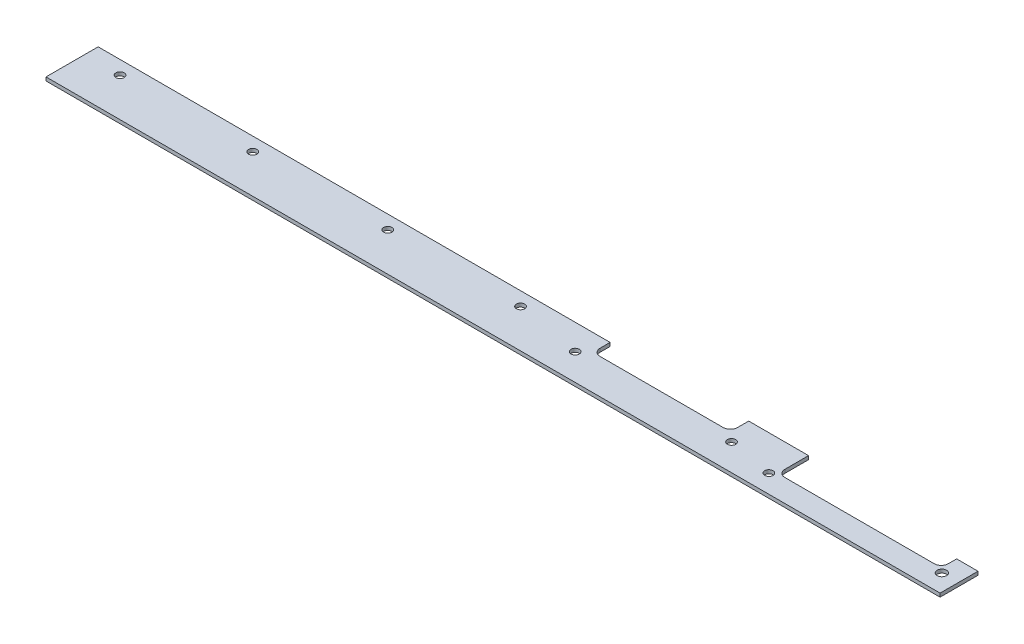
ISO-10303-21;
HEADER;
FILE_DESCRIPTION(('STEP AP214'),'2;1');
FILE_NAME('part.step','',(''),(''),'','','');
FILE_SCHEMA(('AUTOMOTIVE_DESIGN { 1 0 10303 214 1 1 1 1 }'));
ENDSEC;
DATA;
#1=APPLICATION_CONTEXT('core data for automotive mechanical design processes');
#2=APPLICATION_PROTOCOL_DEFINITION('international standard','automotive_design',2000,#1);
#3=PRODUCT_CONTEXT('',#1,'mechanical');
#4=PRODUCT('Part','Part','',(#3));
#5=PRODUCT_RELATED_PRODUCT_CATEGORY('part','',(#4));
#6=PRODUCT_DEFINITION_FORMATION('','',#4);
#7=PRODUCT_DEFINITION_CONTEXT('part definition',#1,'design');
#8=PRODUCT_DEFINITION('design','',#6,#7);
#9=PRODUCT_DEFINITION_SHAPE('','',#8);
#10=(LENGTH_UNIT() NAMED_UNIT(*) SI_UNIT(.MILLI.,.METRE.));
#11=(NAMED_UNIT(*) PLANE_ANGLE_UNIT() SI_UNIT($,.RADIAN.));
#12=(NAMED_UNIT(*) SI_UNIT($,.STERADIAN.) SOLID_ANGLE_UNIT());
#13=UNCERTAINTY_MEASURE_WITH_UNIT(LENGTH_MEASURE(1.E-05),#10,'distance_accuracy_value','');
#14=(GEOMETRIC_REPRESENTATION_CONTEXT(3) GLOBAL_UNCERTAINTY_ASSIGNED_CONTEXT((#13)) GLOBAL_UNIT_ASSIGNED_CONTEXT((#10,
#11,#12)) REPRESENTATION_CONTEXT('',''));
#15=CARTESIAN_POINT('',(0.,0.,0.));
#16=DIRECTION('',(0.,0.,1.));
#17=DIRECTION('',(1.,0.,0.));
#18=AXIS2_PLACEMENT_3D('',#15,#16,#17);
#19=CARTESIAN_POINT('',(219.05,1.5,-17.75));
#20=DIRECTION('',(0.,1.,0.));
#21=DIRECTION('',(0.,0.,1.));
#22=AXIS2_PLACEMENT_3D('',#19,#20,#21);
#23=PLANE('',#22);
#24=CARTESIAN_POINT('',(212.05,1.5,-11.25));
#25=DIRECTION('',(0.,1.,0.));
#26=DIRECTION('',(0.,0.,1.));
#27=AXIS2_PLACEMENT_3D('',#24,#25,#26);
#28=CIRCLE('',#27,1.74999999999998);
#29=CARTESIAN_POINT('',(212.05,1.5,-9.50000000000002));
#30=VERTEX_POINT('',#29);
#31=EDGE_CURVE('E412',#30,#30,#28,.T.);
#32=ORIENTED_EDGE('',*,*,#31,.F.);
#33=EDGE_LOOP('',(#32));
#34=FACE_BOUND('',#33,.T.);
#35=CARTESIAN_POINT('',(184.,1.5,-16.25));
#36=DIRECTION('',(0.,1.,0.));
#37=DIRECTION('',(0.,0.,1.));
#38=AXIS2_PLACEMENT_3D('',#35,#36,#37);
#39=CIRCLE('',#38,1.74999999999998);
#40=CARTESIAN_POINT('',(184.,1.5,-14.5));
#41=VERTEX_POINT('',#40);
#42=EDGE_CURVE('E428',#41,#41,#39,.T.);
#43=ORIENTED_EDGE('',*,*,#42,.F.);
#44=EDGE_LOOP('',(#43));
#45=FACE_BOUND('',#44,.T.);
#46=CARTESIAN_POINT('',(297.3,1.5,-7.75));
#47=DIRECTION('',(0.,1.,0.));
#48=DIRECTION('',(0.,0.,1.));
#49=AXIS2_PLACEMENT_3D('',#46,#47,#48);
#50=CIRCLE('',#49,1.75000000000004);
#51=CARTESIAN_POINT('',(297.3,1.5,-5.99999999999996));
#52=VERTEX_POINT('',#51);
#53=EDGE_CURVE('E444',#52,#52,#50,.T.);
#54=ORIENTED_EDGE('',*,*,#53,.F.);
#55=EDGE_LOOP('',(#54));
#56=FACE_BOUND('',#55,.T.);
#57=CARTESIAN_POINT('',(15.,1.5,-16.25));
#58=DIRECTION('',(0.,1.,0.));
#59=DIRECTION('',(0.,0.,1.));
#60=AXIS2_PLACEMENT_3D('',#57,#58,#59);
#61=CIRCLE('',#60,1.75);
#62=CARTESIAN_POINT('',(15.,1.5,-14.5));
#63=VERTEX_POINT('',#62);
#64=EDGE_CURVE('E194',#63,#63,#61,.T.);
#65=ORIENTED_EDGE('',*,*,#64,.F.);
#66=EDGE_LOOP('',(#65));
#67=FACE_BOUND('',#66,.T.);
#68=DIRECTION('',(0.,0.,1.));
#69=VECTOR('',#68,1.);
#70=CARTESIAN_POINT('',(0.,1.5,0.));
#71=LINE('',#70,#69);
#72=CARTESIAN_POINT('',(0.,1.5,-22.));
#73=VERTEX_POINT('',#72);
#74=CARTESIAN_POINT('',(0.,1.5,0.));
#75=VERTEX_POINT('',#74);
#76=EDGE_CURVE('E236',#73,#75,#71,.T.);
#77=ORIENTED_EDGE('',*,*,#76,.T.);
#78=DIRECTION('',(1.,0.,0.));
#79=VECTOR('',#78,1.);
#80=CARTESIAN_POINT('',(0.,1.5,0.));
#81=LINE('',#80,#79);
#82=CARTESIAN_POINT('',(377.3,1.5,0.));
#83=VERTEX_POINT('',#82);
#84=EDGE_CURVE('E124',#75,#83,#81,.T.);
#85=ORIENTED_EDGE('',*,*,#84,.T.);
#86=DIRECTION('',(0.,0.,-1.));
#87=VECTOR('',#86,1.);
#88=CARTESIAN_POINT('',(377.3,1.5,-16.));
#89=LINE('',#88,#87);
#90=CARTESIAN_POINT('',(377.3,1.5,-16.));
#91=VERTEX_POINT('',#90);
#92=EDGE_CURVE('E289',#83,#91,#89,.T.);
#93=ORIENTED_EDGE('',*,*,#92,.T.);
#94=DIRECTION('',(-1.,0.,0.));
#95=VECTOR('',#94,1.);
#96=CARTESIAN_POINT('',(368.3,1.5,-16.));
#97=LINE('',#96,#95);
#98=CARTESIAN_POINT('',(368.3,1.5,-16.));
#99=VERTEX_POINT('',#98);
#100=EDGE_CURVE('E309',#91,#99,#97,.T.);
#101=ORIENTED_EDGE('',*,*,#100,.T.);
#102=DIRECTION('',(0.,0.,1.));
#103=VECTOR('',#102,1.);
#104=CARTESIAN_POINT('',(368.3,1.5,-12.5));
#105=LINE('',#104,#103);
#106=CARTESIAN_POINT('',(368.3,1.5,-12.5));
#107=VERTEX_POINT('',#106);
#108=EDGE_CURVE('E305',#99,#107,#105,.T.);
#109=ORIENTED_EDGE('',*,*,#108,.T.);
#110=CARTESIAN_POINT('',(365.3,1.5,-12.5));
#111=DIRECTION('',(0.,-1.,0.));
#112=DIRECTION('',(0.,0.,1.));
#113=AXIS2_PLACEMENT_3D('',#110,#111,#112);
#114=CIRCLE('',#113,3.);
#115=CARTESIAN_POINT('',(365.3,1.5,-9.5));
#116=VERTEX_POINT('',#115);
#117=EDGE_CURVE('E308',#107,#116,#114,.T.);
#118=ORIENTED_EDGE('',*,*,#117,.T.);
#119=DIRECTION('',(-1.,0.,0.));
#120=VECTOR('',#119,1.);
#121=CARTESIAN_POINT('',(302.3,1.5,-9.5));
#122=LINE('',#121,#120);
#123=CARTESIAN_POINT('',(302.3,1.5,-9.5));
#124=VERTEX_POINT('',#123);
#125=EDGE_CURVE('E313',#116,#124,#122,.T.);
#126=ORIENTED_EDGE('',*,*,#125,.T.);
#127=CARTESIAN_POINT('',(302.3,1.5,-12.5));
#128=DIRECTION('',(0.,-1.,0.));
#129=DIRECTION('',(0.,0.,1.));
#130=AXIS2_PLACEMENT_3D('',#127,#128,#129);
#131=CIRCLE('',#130,3.);
#132=CARTESIAN_POINT('',(299.3,1.5,-12.5));
#133=VERTEX_POINT('',#132);
#134=EDGE_CURVE('E320',#124,#133,#131,.T.);
#135=ORIENTED_EDGE('',*,*,#134,.T.);
#136=DIRECTION('',(0.,0.,-1.));
#137=VECTOR('',#136,1.);
#138=CARTESIAN_POINT('',(299.3,1.5,-22.5));
#139=LINE('',#138,#137);
#140=CARTESIAN_POINT('',(299.3,1.5,-22.5));
#141=VERTEX_POINT('',#140);
#142=EDGE_CURVE('E323',#133,#141,#139,.T.);
#143=ORIENTED_EDGE('',*,*,#142,.T.);
#144=DIRECTION('',(-1.,0.,0.));
#145=VECTOR('',#144,1.);
#146=CARTESIAN_POINT('',(299.3,1.5,-22.5));
#147=LINE('',#146,#145);
#148=CARTESIAN_POINT('',(274.05,1.5,-22.5));
#149=VERTEX_POINT('',#148);
#150=EDGE_CURVE('E326',#141,#149,#147,.T.);
#151=ORIENTED_EDGE('',*,*,#150,.T.);
#152=DIRECTION('',(0.,0.,1.));
#153=VECTOR('',#152,1.);
#154=CARTESIAN_POINT('',(274.05,1.5,-22.5));
#155=LINE('',#154,#153);
#156=CARTESIAN_POINT('',(274.05,1.5,-17.75));
#157=VERTEX_POINT('',#156);
#158=EDGE_CURVE('E329',#149,#157,#155,.T.);
#159=ORIENTED_EDGE('',*,*,#158,.T.);
#160=CARTESIAN_POINT('',(271.05,1.5,-17.75));
#161=DIRECTION('',(0.,-1.,0.));
#162=DIRECTION('',(0.,0.,-1.));
#163=AXIS2_PLACEMENT_3D('',#160,#161,#162);
#164=CIRCLE('',#163,3.);
#165=CARTESIAN_POINT('',(271.05,1.5,-14.75));
#166=VERTEX_POINT('',#165);
#167=EDGE_CURVE('E332',#157,#166,#164,.T.);
#168=ORIENTED_EDGE('',*,*,#167,.T.);
#169=DIRECTION('',(-1.,0.,0.));
#170=VECTOR('',#169,1.);
#171=CARTESIAN_POINT('',(271.05,1.5,-14.75));
#172=LINE('',#171,#170);
#173=CARTESIAN_POINT('',(219.05,1.5,-14.75));
#174=VERTEX_POINT('',#173);
#175=EDGE_CURVE('E167',#166,#174,#172,.T.);
#176=ORIENTED_EDGE('',*,*,#175,.T.);
#177=CARTESIAN_POINT('',(219.05,1.5,-17.75));
#178=DIRECTION('',(0.,-1.,0.));
#179=DIRECTION('',(0.,0.,1.));
#180=AXIS2_PLACEMENT_3D('',#177,#178,#179);
#181=CIRCLE('',#180,3.);
#182=CARTESIAN_POINT('',(216.05,1.5,-17.75));
#183=VERTEX_POINT('',#182);
#184=EDGE_CURVE('E161',#174,#183,#181,.T.);
#185=ORIENTED_EDGE('',*,*,#184,.T.);
#186=DIRECTION('',(0.,0.,-1.));
#187=VECTOR('',#186,1.);
#188=CARTESIAN_POINT('',(216.05,1.5,-22.));
#189=LINE('',#188,#187);
#190=CARTESIAN_POINT('',(216.05,1.5,-22.));
#191=VERTEX_POINT('',#190);
#192=EDGE_CURVE('E165',#183,#191,#189,.T.);
#193=ORIENTED_EDGE('',*,*,#192,.T.);
#194=DIRECTION('',(-1.,0.,0.));
#195=VECTOR('',#194,1.);
#196=CARTESIAN_POINT('',(0.,1.5,-22.));
#197=LINE('',#196,#195);
#198=EDGE_CURVE('E57',#191,#73,#197,.T.);
#199=ORIENTED_EDGE('',*,*,#198,.T.);
#200=EDGE_LOOP('',(#77,#85,#93,#101,#109,#118,#126,#135,#143,#151,#159,#168,#176,#185,#193,#199));
#201=FACE_BOUND('',#200,.T.);
#202=CARTESIAN_POINT('',(71.,1.5,-16.25));
#203=DIRECTION('',(0.,1.,0.));
#204=DIRECTION('',(0.,0.,1.));
#205=AXIS2_PLACEMENT_3D('',#202,#203,#204);
#206=CIRCLE('',#205,1.75);
#207=CARTESIAN_POINT('',(71.,1.5,-14.5));
#208=VERTEX_POINT('',#207);
#209=EDGE_CURVE('E452',#208,#208,#206,.T.);
#210=ORIENTED_EDGE('',*,*,#209,.F.);
#211=EDGE_LOOP('',(#210));
#212=FACE_BOUND('',#211,.T.);
#213=CARTESIAN_POINT('',(128.,1.5,-16.25));
#214=DIRECTION('',(0.,1.,0.));
#215=DIRECTION('',(0.,0.,1.));
#216=AXIS2_PLACEMENT_3D('',#213,#214,#215);
#217=CIRCLE('',#216,1.75000000000001);
#218=CARTESIAN_POINT('',(128.,1.5,-14.5));
#219=VERTEX_POINT('',#218);
#220=EDGE_CURVE('E436',#219,#219,#217,.T.);
#221=ORIENTED_EDGE('',*,*,#220,.F.);
#222=EDGE_LOOP('',(#221));
#223=FACE_BOUND('',#222,.T.);
#224=CARTESIAN_POINT('',(370.3,1.5,-7.75));
#225=DIRECTION('',(0.,1.,0.));
#226=DIRECTION('',(0.,0.,1.));
#227=AXIS2_PLACEMENT_3D('',#224,#225,#226);
#228=CIRCLE('',#227,2.);
#229=CARTESIAN_POINT('',(370.3,1.5,-5.75));
#230=VERTEX_POINT('',#229);
#231=EDGE_CURVE('E420',#230,#230,#228,.T.);
#232=ORIENTED_EDGE('',*,*,#231,.F.);
#233=EDGE_LOOP('',(#232));
#234=FACE_BOUND('',#233,.T.);
#235=CARTESIAN_POINT('',(278.05,1.5,-11.25));
#236=DIRECTION('',(0.,1.,0.));
#237=DIRECTION('',(0.,0.,1.));
#238=AXIS2_PLACEMENT_3D('',#235,#236,#237);
#239=CIRCLE('',#238,1.75000000000004);
#240=CARTESIAN_POINT('',(278.05,1.5,-9.49999999999996));
#241=VERTEX_POINT('',#240);
#242=EDGE_CURVE('E401',#241,#241,#239,.T.);
#243=ORIENTED_EDGE('',*,*,#242,.F.);
#244=EDGE_LOOP('',(#243));
#245=FACE_BOUND('',#244,.T.);
#246=ADVANCED_FACE('F39',(#34,#45,#56,#67,#201,#212,#223,#234,#245),#23,.T.);
#247=CARTESIAN_POINT('',(219.05,0.,-17.75));
#248=DIRECTION('',(0.,1.,0.));
#249=DIRECTION('',(0.,0.,1.));
#250=AXIS2_PLACEMENT_3D('',#247,#248,#249);
#251=PLANE('',#250);
#252=DIRECTION('',(0.,0.,1.));
#253=VECTOR('',#252,1.);
#254=CARTESIAN_POINT('',(0.,0.,0.));
#255=LINE('',#254,#253);
#256=CARTESIAN_POINT('',(0.,0.,-22.));
#257=VERTEX_POINT('',#256);
#258=CARTESIAN_POINT('',(0.,0.,0.));
#259=VERTEX_POINT('',#258);
#260=EDGE_CURVE('E189',#257,#259,#255,.T.);
#261=ORIENTED_EDGE('',*,*,#260,.F.);
#262=DIRECTION('',(-1.,0.,0.));
#263=VECTOR('',#262,1.);
#264=CARTESIAN_POINT('',(0.,0.,-22.));
#265=LINE('',#264,#263);
#266=CARTESIAN_POINT('',(216.05,0.,-22.));
#267=VERTEX_POINT('',#266);
#268=EDGE_CURVE('E116',#267,#257,#265,.T.);
#269=ORIENTED_EDGE('',*,*,#268,.F.);
#270=DIRECTION('',(0.,0.,-1.));
#271=VECTOR('',#270,1.);
#272=CARTESIAN_POINT('',(216.05,0.,-22.));
#273=LINE('',#272,#271);
#274=CARTESIAN_POINT('',(216.05,0.,-17.75));
#275=VERTEX_POINT('',#274);
#276=EDGE_CURVE('E110',#275,#267,#273,.T.);
#277=ORIENTED_EDGE('',*,*,#276,.F.);
#278=CARTESIAN_POINT('',(219.05,0.,-17.75));
#279=DIRECTION('',(0.,-1.,0.));
#280=DIRECTION('',(0.,0.,1.));
#281=AXIS2_PLACEMENT_3D('',#278,#279,#280);
#282=CIRCLE('',#281,3.);
#283=CARTESIAN_POINT('',(219.05,0.,-14.75));
#284=VERTEX_POINT('',#283);
#285=EDGE_CURVE('E176',#284,#275,#282,.T.);
#286=ORIENTED_EDGE('',*,*,#285,.F.);
#287=DIRECTION('',(-1.,0.,0.));
#288=VECTOR('',#287,1.);
#289=CARTESIAN_POINT('',(271.05,0.,-14.75));
#290=LINE('',#289,#288);
#291=CARTESIAN_POINT('',(271.05,0.,-14.75));
#292=VERTEX_POINT('',#291);
#293=EDGE_CURVE('E227',#292,#284,#290,.T.);
#294=ORIENTED_EDGE('',*,*,#293,.F.);
#295=CARTESIAN_POINT('',(271.05,0.,-17.75));
#296=DIRECTION('',(0.,-1.,0.));
#297=DIRECTION('',(0.,0.,-1.));
#298=AXIS2_PLACEMENT_3D('',#295,#296,#297);
#299=CIRCLE('',#298,3.);
#300=CARTESIAN_POINT('',(274.05,0.,-17.75));
#301=VERTEX_POINT('',#300);
#302=EDGE_CURVE('E224',#301,#292,#299,.T.);
#303=ORIENTED_EDGE('',*,*,#302,.F.);
#304=DIRECTION('',(0.,0.,1.));
#305=VECTOR('',#304,1.);
#306=CARTESIAN_POINT('',(274.05,0.,-22.5));
#307=LINE('',#306,#305);
#308=CARTESIAN_POINT('',(274.05,0.,-22.5));
#309=VERTEX_POINT('',#308);
#310=EDGE_CURVE('E221',#309,#301,#307,.T.);
#311=ORIENTED_EDGE('',*,*,#310,.F.);
#312=DIRECTION('',(-1.,0.,0.));
#313=VECTOR('',#312,1.);
#314=CARTESIAN_POINT('',(299.3,0.,-22.5));
#315=LINE('',#314,#313);
#316=CARTESIAN_POINT('',(299.3,0.,-22.5));
#317=VERTEX_POINT('',#316);
#318=EDGE_CURVE('E218',#317,#309,#315,.T.);
#319=ORIENTED_EDGE('',*,*,#318,.F.);
#320=DIRECTION('',(0.,0.,-1.));
#321=VECTOR('',#320,1.);
#322=CARTESIAN_POINT('',(299.3,0.,-22.5));
#323=LINE('',#322,#321);
#324=CARTESIAN_POINT('',(299.3,0.,-12.5));
#325=VERTEX_POINT('',#324);
#326=EDGE_CURVE('E215',#325,#317,#323,.T.);
#327=ORIENTED_EDGE('',*,*,#326,.F.);
#328=CARTESIAN_POINT('',(302.3,0.,-12.5));
#329=DIRECTION('',(0.,-1.,0.));
#330=DIRECTION('',(0.,0.,1.));
#331=AXIS2_PLACEMENT_3D('',#328,#329,#330);
#332=CIRCLE('',#331,3.);
#333=CARTESIAN_POINT('',(302.3,0.,-9.5));
#334=VERTEX_POINT('',#333);
#335=EDGE_CURVE('E212',#334,#325,#332,.T.);
#336=ORIENTED_EDGE('',*,*,#335,.F.);
#337=DIRECTION('',(-1.,0.,0.));
#338=VECTOR('',#337,1.);
#339=CARTESIAN_POINT('',(302.3,0.,-9.5));
#340=LINE('',#339,#338);
#341=CARTESIAN_POINT('',(365.3,0.,-9.5));
#342=VERTEX_POINT('',#341);
#343=EDGE_CURVE('E209',#342,#334,#340,.T.);
#344=ORIENTED_EDGE('',*,*,#343,.F.);
#345=CARTESIAN_POINT('',(365.3,0.,-12.5));
#346=DIRECTION('',(0.,-1.,0.));
#347=DIRECTION('',(0.,0.,1.));
#348=AXIS2_PLACEMENT_3D('',#345,#346,#347);
#349=CIRCLE('',#348,3.);
#350=CARTESIAN_POINT('',(368.3,0.,-12.5));
#351=VERTEX_POINT('',#350);
#352=EDGE_CURVE('E206',#351,#342,#349,.T.);
#353=ORIENTED_EDGE('',*,*,#352,.F.);
#354=DIRECTION('',(0.,0.,1.));
#355=VECTOR('',#354,1.);
#356=CARTESIAN_POINT('',(368.3,0.,-12.5));
#357=LINE('',#356,#355);
#358=CARTESIAN_POINT('',(368.3,0.,-16.));
#359=VERTEX_POINT('',#358);
#360=EDGE_CURVE('E203',#359,#351,#357,.T.);
#361=ORIENTED_EDGE('',*,*,#360,.F.);
#362=DIRECTION('',(-1.,0.,0.));
#363=VECTOR('',#362,1.);
#364=CARTESIAN_POINT('',(368.3,0.,-16.));
#365=LINE('',#364,#363);
#366=CARTESIAN_POINT('',(377.3,0.,-16.));
#367=VERTEX_POINT('',#366);
#368=EDGE_CURVE('E200',#367,#359,#365,.T.);
#369=ORIENTED_EDGE('',*,*,#368,.F.);
#370=DIRECTION('',(0.,0.,-1.));
#371=VECTOR('',#370,1.);
#372=CARTESIAN_POINT('',(377.3,0.,-16.));
#373=LINE('',#372,#371);
#374=CARTESIAN_POINT('',(377.3,0.,0.));
#375=VERTEX_POINT('',#374);
#376=EDGE_CURVE('E197',#375,#367,#373,.T.);
#377=ORIENTED_EDGE('',*,*,#376,.F.);
#378=DIRECTION('',(1.,0.,0.));
#379=VECTOR('',#378,1.);
#380=CARTESIAN_POINT('',(0.,0.,0.));
#381=LINE('',#380,#379);
#382=EDGE_CURVE('E193',#259,#375,#381,.T.);
#383=ORIENTED_EDGE('',*,*,#382,.F.);
#384=EDGE_LOOP('',(#261,#269,#277,#286,#294,#303,#311,#319,#327,#336,#344,#353,#361,#369,#377,#383));
#385=FACE_BOUND('',#384,.T.);
#386=CARTESIAN_POINT('',(15.,0.,-16.25));
#387=DIRECTION('',(0.,1.,0.));
#388=DIRECTION('',(0.,0.,1.));
#389=AXIS2_PLACEMENT_3D('',#386,#387,#388);
#390=CIRCLE('',#389,1.75);
#391=CARTESIAN_POINT('',(15.,0.,-14.5));
#392=VERTEX_POINT('',#391);
#393=EDGE_CURVE('E456',#392,#392,#390,.T.);
#394=ORIENTED_EDGE('',*,*,#393,.T.);
#395=EDGE_LOOP('',(#394));
#396=FACE_BOUND('',#395,.T.);
#397=CARTESIAN_POINT('',(71.,0.,-16.25));
#398=DIRECTION('',(0.,1.,0.));
#399=DIRECTION('',(0.,0.,1.));
#400=AXIS2_PLACEMENT_3D('',#397,#398,#399);
#401=CIRCLE('',#400,1.75);
#402=CARTESIAN_POINT('',(71.,0.,-14.5));
#403=VERTEX_POINT('',#402);
#404=EDGE_CURVE('E448',#403,#403,#401,.T.);
#405=ORIENTED_EDGE('',*,*,#404,.T.);
#406=EDGE_LOOP('',(#405));
#407=FACE_BOUND('',#406,.T.);
#408=CARTESIAN_POINT('',(297.3,0.,-7.75));
#409=DIRECTION('',(0.,1.,0.));
#410=DIRECTION('',(0.,0.,1.));
#411=AXIS2_PLACEMENT_3D('',#408,#409,#410);
#412=CIRCLE('',#411,1.75000000000004);
#413=CARTESIAN_POINT('',(297.3,0.,-5.99999999999996));
#414=VERTEX_POINT('',#413);
#415=EDGE_CURVE('E440',#414,#414,#412,.T.);
#416=ORIENTED_EDGE('',*,*,#415,.T.);
#417=EDGE_LOOP('',(#416));
#418=FACE_BOUND('',#417,.T.);
#419=CARTESIAN_POINT('',(128.,0.,-16.25));
#420=DIRECTION('',(0.,1.,0.));
#421=DIRECTION('',(0.,0.,1.));
#422=AXIS2_PLACEMENT_3D('',#419,#420,#421);
#423=CIRCLE('',#422,1.75000000000001);
#424=CARTESIAN_POINT('',(128.,0.,-14.5));
#425=VERTEX_POINT('',#424);
#426=EDGE_CURVE('E432',#425,#425,#423,.T.);
#427=ORIENTED_EDGE('',*,*,#426,.T.);
#428=EDGE_LOOP('',(#427));
#429=FACE_BOUND('',#428,.T.);
#430=CARTESIAN_POINT('',(184.,0.,-16.25));
#431=DIRECTION('',(0.,1.,0.));
#432=DIRECTION('',(0.,0.,1.));
#433=AXIS2_PLACEMENT_3D('',#430,#431,#432);
#434=CIRCLE('',#433,1.74999999999998);
#435=CARTESIAN_POINT('',(184.,0.,-14.5));
#436=VERTEX_POINT('',#435);
#437=EDGE_CURVE('E424',#436,#436,#434,.T.);
#438=ORIENTED_EDGE('',*,*,#437,.T.);
#439=EDGE_LOOP('',(#438));
#440=FACE_BOUND('',#439,.T.);
#441=CARTESIAN_POINT('',(370.3,0.,-7.75));
#442=DIRECTION('',(0.,1.,0.));
#443=DIRECTION('',(0.,0.,1.));
#444=AXIS2_PLACEMENT_3D('',#441,#442,#443);
#445=CIRCLE('',#444,2.);
#446=CARTESIAN_POINT('',(370.3,0.,-5.75));
#447=VERTEX_POINT('',#446);
#448=EDGE_CURVE('E416',#447,#447,#445,.T.);
#449=ORIENTED_EDGE('',*,*,#448,.T.);
#450=EDGE_LOOP('',(#449));
#451=FACE_BOUND('',#450,.T.);
#452=CARTESIAN_POINT('',(212.05,0.,-11.25));
#453=DIRECTION('',(0.,1.,0.));
#454=DIRECTION('',(0.,0.,1.));
#455=AXIS2_PLACEMENT_3D('',#452,#453,#454);
#456=CIRCLE('',#455,1.74999999999998);
#457=CARTESIAN_POINT('',(212.05,0.,-9.50000000000002));
#458=VERTEX_POINT('',#457);
#459=EDGE_CURVE('E409',#458,#458,#456,.T.);
#460=ORIENTED_EDGE('',*,*,#459,.T.);
#461=EDGE_LOOP('',(#460));
#462=FACE_BOUND('',#461,.T.);
#463=CARTESIAN_POINT('',(278.05,0.,-11.25));
#464=DIRECTION('',(0.,1.,0.));
#465=DIRECTION('',(0.,0.,1.));
#466=AXIS2_PLACEMENT_3D('',#463,#464,#465);
#467=CIRCLE('',#466,1.75000000000004);
#468=CARTESIAN_POINT('',(278.05,0.,-9.49999999999996));
#469=VERTEX_POINT('',#468);
#470=EDGE_CURVE('E404',#469,#469,#467,.T.);
#471=ORIENTED_EDGE('',*,*,#470,.T.);
#472=EDGE_LOOP('',(#471));
#473=FACE_BOUND('',#472,.T.);
#474=ADVANCED_FACE('F293',(#385,#396,#407,#418,#429,#440,#451,#462,#473),#251,.F.);
#475=CARTESIAN_POINT('',(0.,1.5,0.));
#476=DIRECTION('',(1.,0.,0.));
#477=DIRECTION('',(0.,0.,-1.));
#478=AXIS2_PLACEMENT_3D('',#475,#476,#477);
#479=PLANE('',#478);
#480=ORIENTED_EDGE('',*,*,#260,.T.);
#481=DIRECTION('',(0.,-1.,0.));
#482=VECTOR('',#481,1.);
#483=CARTESIAN_POINT('',(0.,1.5,0.));
#484=LINE('',#483,#482);
#485=EDGE_CURVE('E11',#75,#259,#484,.T.);
#486=ORIENTED_EDGE('',*,*,#485,.F.);
#487=ORIENTED_EDGE('',*,*,#76,.F.);
#488=DIRECTION('',(0.,-1.,0.));
#489=VECTOR('',#488,1.);
#490=CARTESIAN_POINT('',(0.,1.5,-22.));
#491=LINE('',#490,#489);
#492=EDGE_CURVE('E185',#73,#257,#491,.T.);
#493=ORIENTED_EDGE('',*,*,#492,.T.);
#494=EDGE_LOOP('',(#480,#486,#487,#493));
#495=FACE_BOUND('',#494,.T.);
#496=ADVANCED_FACE('F41',(#495),#479,.F.);
#497=CARTESIAN_POINT('',(0.,1.5,0.));
#498=DIRECTION('',(0.,0.,-1.));
#499=DIRECTION('',(-1.,0.,0.));
#500=AXIS2_PLACEMENT_3D('',#497,#498,#499);
#501=PLANE('',#500);
#502=ORIENTED_EDGE('',*,*,#382,.T.);
#503=DIRECTION('',(0.,-1.,0.));
#504=VECTOR('',#503,1.);
#505=CARTESIAN_POINT('',(377.3,1.5,0.));
#506=LINE('',#505,#504);
#507=EDGE_CURVE('E49',#83,#375,#506,.T.);
#508=ORIENTED_EDGE('',*,*,#507,.F.);
#509=ORIENTED_EDGE('',*,*,#84,.F.);
#510=ORIENTED_EDGE('',*,*,#485,.T.);
#511=EDGE_LOOP('',(#502,#508,#509,#510));
#512=FACE_BOUND('',#511,.T.);
#513=ADVANCED_FACE('F648',(#512),#501,.F.);
#514=CARTESIAN_POINT('',(377.3,1.5,-16.));
#515=DIRECTION('',(-1.,0.,0.));
#516=DIRECTION('',(0.,0.,1.));
#517=AXIS2_PLACEMENT_3D('',#514,#515,#516);
#518=PLANE('',#517);
#519=ORIENTED_EDGE('',*,*,#376,.T.);
#520=DIRECTION('',(0.,-1.,0.));
#521=VECTOR('',#520,1.);
#522=CARTESIAN_POINT('',(377.3,1.5,-16.));
#523=LINE('',#522,#521);
#524=EDGE_CURVE('E279',#91,#367,#523,.T.);
#525=ORIENTED_EDGE('',*,*,#524,.F.);
#526=ORIENTED_EDGE('',*,*,#92,.F.);
#527=ORIENTED_EDGE('',*,*,#507,.T.);
#528=EDGE_LOOP('',(#519,#525,#526,#527));
#529=FACE_BOUND('',#528,.T.);
#530=ADVANCED_FACE('F287',(#529),#518,.F.);
#531=CARTESIAN_POINT('',(368.3,1.5,-16.));
#532=DIRECTION('',(0.,0.,1.));
#533=DIRECTION('',(1.,0.,0.));
#534=AXIS2_PLACEMENT_3D('',#531,#532,#533);
#535=PLANE('',#534);
#536=ORIENTED_EDGE('',*,*,#368,.T.);
#537=DIRECTION('',(0.,-1.,0.));
#538=VECTOR('',#537,1.);
#539=CARTESIAN_POINT('',(368.3,1.5,-16.));
#540=LINE('',#539,#538);
#541=EDGE_CURVE('E275',#99,#359,#540,.T.);
#542=ORIENTED_EDGE('',*,*,#541,.F.);
#543=ORIENTED_EDGE('',*,*,#100,.F.);
#544=ORIENTED_EDGE('',*,*,#524,.T.);
#545=EDGE_LOOP('',(#536,#542,#543,#544));
#546=FACE_BOUND('',#545,.T.);
#547=ADVANCED_FACE('F299',(#546),#535,.F.);
#548=CARTESIAN_POINT('',(368.3,1.5,-12.5));
#549=DIRECTION('',(1.,0.,0.));
#550=DIRECTION('',(0.,0.,-1.));
#551=AXIS2_PLACEMENT_3D('',#548,#549,#550);
#552=PLANE('',#551);
#553=ORIENTED_EDGE('',*,*,#360,.T.);
#554=DIRECTION('',(0.,-1.,0.));
#555=VECTOR('',#554,1.);
#556=CARTESIAN_POINT('',(368.3,1.5,-12.5));
#557=LINE('',#556,#555);
#558=EDGE_CURVE('E271',#107,#351,#557,.T.);
#559=ORIENTED_EDGE('',*,*,#558,.F.);
#560=ORIENTED_EDGE('',*,*,#108,.F.);
#561=ORIENTED_EDGE('',*,*,#541,.T.);
#562=EDGE_LOOP('',(#553,#559,#560,#561));
#563=FACE_BOUND('',#562,.T.);
#564=ADVANCED_FACE('F303',(#563),#552,.F.);
#565=CARTESIAN_POINT('',(365.3,1.5,-12.5));
#566=DIRECTION('',(0.,-1.,0.));
#567=DIRECTION('',(0.,0.,-1.));
#568=AXIS2_PLACEMENT_3D('',#565,#566,#567);
#569=CYLINDRICAL_SURFACE('',#568,3.);
#570=ORIENTED_EDGE('',*,*,#352,.T.);
#571=DIRECTION('',(0.,-1.,0.));
#572=VECTOR('',#571,1.);
#573=CARTESIAN_POINT('',(365.3,1.5,-9.5));
#574=LINE('',#573,#572);
#575=EDGE_CURVE('E267',#116,#342,#574,.T.);
#576=ORIENTED_EDGE('',*,*,#575,.F.);
#577=ORIENTED_EDGE('',*,*,#117,.F.);
#578=ORIENTED_EDGE('',*,*,#558,.T.);
#579=EDGE_LOOP('',(#570,#576,#577,#578));
#580=FACE_BOUND('',#579,.T.);
#581=ADVANCED_FACE('F613',(#580),#569,.F.);
#582=CARTESIAN_POINT('',(302.3,1.5,-9.5));
#583=DIRECTION('',(0.,0.,1.));
#584=DIRECTION('',(1.,0.,0.));
#585=AXIS2_PLACEMENT_3D('',#582,#583,#584);
#586=PLANE('',#585);
#587=ORIENTED_EDGE('',*,*,#343,.T.);
#588=DIRECTION('',(0.,-1.,0.));
#589=VECTOR('',#588,1.);
#590=CARTESIAN_POINT('',(302.3,1.5,-9.5));
#591=LINE('',#590,#589);
#592=EDGE_CURVE('E263',#124,#334,#591,.T.);
#593=ORIENTED_EDGE('',*,*,#592,.F.);
#594=ORIENTED_EDGE('',*,*,#125,.F.);
#595=ORIENTED_EDGE('',*,*,#575,.T.);
#596=EDGE_LOOP('',(#587,#593,#594,#595));
#597=FACE_BOUND('',#596,.T.);
#598=ADVANCED_FACE('F603',(#597),#586,.F.);
#599=CARTESIAN_POINT('',(302.3,1.5,-12.5));
#600=DIRECTION('',(0.,-1.,0.));
#601=DIRECTION('',(0.,0.,-1.));
#602=AXIS2_PLACEMENT_3D('',#599,#600,#601);
#603=CYLINDRICAL_SURFACE('',#602,3.);
#604=ORIENTED_EDGE('',*,*,#335,.T.);
#605=DIRECTION('',(0.,-1.,0.));
#606=VECTOR('',#605,1.);
#607=CARTESIAN_POINT('',(299.3,1.5,-12.5));
#608=LINE('',#607,#606);
#609=EDGE_CURVE('E259',#133,#325,#608,.T.);
#610=ORIENTED_EDGE('',*,*,#609,.F.);
#611=ORIENTED_EDGE('',*,*,#134,.F.);
#612=ORIENTED_EDGE('',*,*,#592,.T.);
#613=EDGE_LOOP('',(#604,#610,#611,#612));
#614=FACE_BOUND('',#613,.T.);
#615=ADVANCED_FACE('F593',(#614),#603,.F.);
#616=CARTESIAN_POINT('',(299.3,1.5,-22.5));
#617=DIRECTION('',(-1.,0.,0.));
#618=DIRECTION('',(0.,0.,1.));
#619=AXIS2_PLACEMENT_3D('',#616,#617,#618);
#620=PLANE('',#619);
#621=ORIENTED_EDGE('',*,*,#326,.T.);
#622=DIRECTION('',(0.,-1.,0.));
#623=VECTOR('',#622,1.);
#624=CARTESIAN_POINT('',(299.3,1.5,-22.5));
#625=LINE('',#624,#623);
#626=EDGE_CURVE('E255',#141,#317,#625,.T.);
#627=ORIENTED_EDGE('',*,*,#626,.F.);
#628=ORIENTED_EDGE('',*,*,#142,.F.);
#629=ORIENTED_EDGE('',*,*,#609,.T.);
#630=EDGE_LOOP('',(#621,#627,#628,#629));
#631=FACE_BOUND('',#630,.T.);
#632=ADVANCED_FACE('F583',(#631),#620,.F.);
#633=CARTESIAN_POINT('',(299.3,1.5,-22.5));
#634=DIRECTION('',(0.,0.,1.));
#635=DIRECTION('',(1.,0.,0.));
#636=AXIS2_PLACEMENT_3D('',#633,#634,#635);
#637=PLANE('',#636);
#638=ORIENTED_EDGE('',*,*,#318,.T.);
#639=DIRECTION('',(0.,-1.,0.));
#640=VECTOR('',#639,1.);
#641=CARTESIAN_POINT('',(274.05,1.5,-22.5));
#642=LINE('',#641,#640);
#643=EDGE_CURVE('E251',#149,#309,#642,.T.);
#644=ORIENTED_EDGE('',*,*,#643,.F.);
#645=ORIENTED_EDGE('',*,*,#150,.F.);
#646=ORIENTED_EDGE('',*,*,#626,.T.);
#647=EDGE_LOOP('',(#638,#644,#645,#646));
#648=FACE_BOUND('',#647,.T.);
#649=ADVANCED_FACE('F573',(#648),#637,.F.);
#650=CARTESIAN_POINT('',(274.05,1.5,-22.5));
#651=DIRECTION('',(1.,0.,0.));
#652=DIRECTION('',(0.,0.,-1.));
#653=AXIS2_PLACEMENT_3D('',#650,#651,#652);
#654=PLANE('',#653);
#655=ORIENTED_EDGE('',*,*,#310,.T.);
#656=DIRECTION('',(0.,-1.,0.));
#657=VECTOR('',#656,1.);
#658=CARTESIAN_POINT('',(274.05,1.5,-17.75));
#659=LINE('',#658,#657);
#660=EDGE_CURVE('E247',#157,#301,#659,.T.);
#661=ORIENTED_EDGE('',*,*,#660,.F.);
#662=ORIENTED_EDGE('',*,*,#158,.F.);
#663=ORIENTED_EDGE('',*,*,#643,.T.);
#664=EDGE_LOOP('',(#655,#661,#662,#663));
#665=FACE_BOUND('',#664,.T.);
#666=ADVANCED_FACE('F564',(#665),#654,.F.);
#667=CARTESIAN_POINT('',(271.05,1.5,-17.75));
#668=DIRECTION('',(0.,-1.,0.));
#669=DIRECTION('',(0.,0.,-1.));
#670=AXIS2_PLACEMENT_3D('',#667,#668,#669);
#671=CYLINDRICAL_SURFACE('',#670,3.);
#672=ORIENTED_EDGE('',*,*,#302,.T.);
#673=DIRECTION('',(0.,-1.,0.));
#674=VECTOR('',#673,1.);
#675=CARTESIAN_POINT('',(271.05,1.5,-14.75));
#676=LINE('',#675,#674);
#677=EDGE_CURVE('E243',#166,#292,#676,.T.);
#678=ORIENTED_EDGE('',*,*,#677,.F.);
#679=ORIENTED_EDGE('',*,*,#167,.F.);
#680=ORIENTED_EDGE('',*,*,#660,.T.);
#681=EDGE_LOOP('',(#672,#678,#679,#680));
#682=FACE_BOUND('',#681,.T.);
#683=ADVANCED_FACE('F340',(#682),#671,.F.);
#684=CARTESIAN_POINT('',(271.05,1.5,-14.75));
#685=DIRECTION('',(0.,0.,1.));
#686=DIRECTION('',(1.,0.,0.));
#687=AXIS2_PLACEMENT_3D('',#684,#685,#686);
#688=PLANE('',#687);
#689=ORIENTED_EDGE('',*,*,#293,.T.);
#690=DIRECTION('',(0.,-1.,0.));
#691=VECTOR('',#690,1.);
#692=CARTESIAN_POINT('',(219.05,1.5,-14.75));
#693=LINE('',#692,#691);
#694=EDGE_CURVE('E178',#174,#284,#693,.T.);
#695=ORIENTED_EDGE('',*,*,#694,.F.);
#696=ORIENTED_EDGE('',*,*,#175,.F.);
#697=ORIENTED_EDGE('',*,*,#677,.T.);
#698=EDGE_LOOP('',(#689,#695,#696,#697));
#699=FACE_BOUND('',#698,.T.);
#700=ADVANCED_FACE('F344',(#699),#688,.F.);
#701=CARTESIAN_POINT('',(219.05,1.5,-17.75));
#702=DIRECTION('',(0.,-1.,0.));
#703=DIRECTION('',(0.,0.,-1.));
#704=AXIS2_PLACEMENT_3D('',#701,#702,#703);
#705=CYLINDRICAL_SURFACE('',#704,3.);
#706=ORIENTED_EDGE('',*,*,#285,.T.);
#707=DIRECTION('',(0.,-1.,0.));
#708=VECTOR('',#707,1.);
#709=CARTESIAN_POINT('',(216.05,1.5,-17.75));
#710=LINE('',#709,#708);
#711=EDGE_CURVE('E173',#183,#275,#710,.T.);
#712=ORIENTED_EDGE('',*,*,#711,.F.);
#713=ORIENTED_EDGE('',*,*,#184,.F.);
#714=ORIENTED_EDGE('',*,*,#694,.T.);
#715=EDGE_LOOP('',(#706,#712,#713,#714));
#716=FACE_BOUND('',#715,.T.);
#717=ADVANCED_FACE('F174',(#716),#705,.F.);
#718=CARTESIAN_POINT('',(216.05,1.5,-22.));
#719=DIRECTION('',(-1.,0.,0.));
#720=DIRECTION('',(0.,0.,1.));
#721=AXIS2_PLACEMENT_3D('',#718,#719,#720);
#722=PLANE('',#721);
#723=ORIENTED_EDGE('',*,*,#276,.T.);
#724=DIRECTION('',(0.,-1.,0.));
#725=VECTOR('',#724,1.);
#726=CARTESIAN_POINT('',(216.05,1.5,-22.));
#727=LINE('',#726,#725);
#728=EDGE_CURVE('E179',#191,#267,#727,.T.);
#729=ORIENTED_EDGE('',*,*,#728,.F.);
#730=ORIENTED_EDGE('',*,*,#192,.F.);
#731=ORIENTED_EDGE('',*,*,#711,.T.);
#732=EDGE_LOOP('',(#723,#729,#730,#731));
#733=FACE_BOUND('',#732,.T.);
#734=ADVANCED_FACE('F181',(#733),#722,.F.);
#735=CARTESIAN_POINT('',(0.,1.5,-22.));
#736=DIRECTION('',(0.,0.,1.));
#737=DIRECTION('',(1.,0.,0.));
#738=AXIS2_PLACEMENT_3D('',#735,#736,#737);
#739=PLANE('',#738);
#740=ORIENTED_EDGE('',*,*,#268,.T.);
#741=ORIENTED_EDGE('',*,*,#492,.F.);
#742=ORIENTED_EDGE('',*,*,#198,.F.);
#743=ORIENTED_EDGE('',*,*,#728,.T.);
#744=EDGE_LOOP('',(#740,#741,#742,#743));
#745=FACE_BOUND('',#744,.T.);
#746=ADVANCED_FACE('F348',(#745),#739,.F.);
#747=CARTESIAN_POINT('',(15.,1.5,-16.25));
#748=DIRECTION('',(0.,-1.,0.));
#749=DIRECTION('',(0.,0.,-1.));
#750=AXIS2_PLACEMENT_3D('',#747,#748,#749);
#751=CYLINDRICAL_SURFACE('',#750,1.75);
#752=ORIENTED_EDGE('',*,*,#64,.T.);
#753=EDGE_LOOP('',(#752));
#754=FACE_BOUND('',#753,.T.);
#755=ORIENTED_EDGE('',*,*,#393,.F.);
#756=EDGE_LOOP('',(#755));
#757=FACE_BOUND('',#756,.T.);
#758=ADVANCED_FACE('F350',(#754,#757),#751,.F.);
#759=CARTESIAN_POINT('',(71.,1.5,-16.25));
#760=DIRECTION('',(0.,-1.,0.));
#761=DIRECTION('',(0.,0.,-1.));
#762=AXIS2_PLACEMENT_3D('',#759,#760,#761);
#763=CYLINDRICAL_SURFACE('',#762,1.75);
#764=ORIENTED_EDGE('',*,*,#209,.T.);
#765=EDGE_LOOP('',(#764));
#766=FACE_BOUND('',#765,.T.);
#767=ORIENTED_EDGE('',*,*,#404,.F.);
#768=EDGE_LOOP('',(#767));
#769=FACE_BOUND('',#768,.T.);
#770=ADVANCED_FACE('F356',(#766,#769),#763,.F.);
#771=CARTESIAN_POINT('',(297.3,1.5,-7.75));
#772=DIRECTION('',(0.,-1.,0.));
#773=DIRECTION('',(0.,0.,-1.));
#774=AXIS2_PLACEMENT_3D('',#771,#772,#773);
#775=CYLINDRICAL_SURFACE('',#774,1.75000000000004);
#776=ORIENTED_EDGE('',*,*,#53,.T.);
#777=EDGE_LOOP('',(#776));
#778=FACE_BOUND('',#777,.T.);
#779=ORIENTED_EDGE('',*,*,#415,.F.);
#780=EDGE_LOOP('',(#779));
#781=FACE_BOUND('',#780,.T.);
#782=ADVANCED_FACE('F372',(#778,#781),#775,.F.);
#783=CARTESIAN_POINT('',(128.,1.5,-16.25));
#784=DIRECTION('',(0.,-1.,0.));
#785=DIRECTION('',(0.,0.,-1.));
#786=AXIS2_PLACEMENT_3D('',#783,#784,#785);
#787=CYLINDRICAL_SURFACE('',#786,1.75000000000001);
#788=ORIENTED_EDGE('',*,*,#220,.T.);
#789=EDGE_LOOP('',(#788));
#790=FACE_BOUND('',#789,.T.);
#791=ORIENTED_EDGE('',*,*,#426,.F.);
#792=EDGE_LOOP('',(#791));
#793=FACE_BOUND('',#792,.T.);
#794=ADVANCED_FACE('F376',(#790,#793),#787,.F.);
#795=CARTESIAN_POINT('',(184.,1.5,-16.25));
#796=DIRECTION('',(0.,-1.,0.));
#797=DIRECTION('',(0.,0.,-1.));
#798=AXIS2_PLACEMENT_3D('',#795,#796,#797);
#799=CYLINDRICAL_SURFACE('',#798,1.74999999999998);
#800=ORIENTED_EDGE('',*,*,#42,.T.);
#801=EDGE_LOOP('',(#800));
#802=FACE_BOUND('',#801,.T.);
#803=ORIENTED_EDGE('',*,*,#437,.F.);
#804=EDGE_LOOP('',(#803));
#805=FACE_BOUND('',#804,.T.);
#806=ADVANCED_FACE('F380',(#802,#805),#799,.F.);
#807=CARTESIAN_POINT('',(370.3,1.5,-7.75));
#808=DIRECTION('',(0.,-1.,0.));
#809=DIRECTION('',(0.,0.,-1.));
#810=AXIS2_PLACEMENT_3D('',#807,#808,#809);
#811=CYLINDRICAL_SURFACE('',#810,2.);
#812=ORIENTED_EDGE('',*,*,#231,.T.);
#813=EDGE_LOOP('',(#812));
#814=FACE_BOUND('',#813,.T.);
#815=ORIENTED_EDGE('',*,*,#448,.F.);
#816=EDGE_LOOP('',(#815));
#817=FACE_BOUND('',#816,.T.);
#818=ADVANCED_FACE('F384',(#814,#817),#811,.F.);
#819=CARTESIAN_POINT('',(212.05,1.5,-11.25));
#820=DIRECTION('',(0.,-1.,0.));
#821=DIRECTION('',(0.,0.,-1.));
#822=AXIS2_PLACEMENT_3D('',#819,#820,#821);
#823=CYLINDRICAL_SURFACE('',#822,1.74999999999998);
#824=ORIENTED_EDGE('',*,*,#31,.T.);
#825=EDGE_LOOP('',(#824));
#826=FACE_BOUND('',#825,.T.);
#827=ORIENTED_EDGE('',*,*,#459,.F.);
#828=EDGE_LOOP('',(#827));
#829=FACE_BOUND('',#828,.T.);
#830=ADVANCED_FACE('F388',(#826,#829),#823,.F.);
#831=CARTESIAN_POINT('',(278.05,1.5,-11.25));
#832=DIRECTION('',(0.,-1.,0.));
#833=DIRECTION('',(0.,0.,-1.));
#834=AXIS2_PLACEMENT_3D('',#831,#832,#833);
#835=CYLINDRICAL_SURFACE('',#834,1.75000000000004);
#836=ORIENTED_EDGE('',*,*,#242,.T.);
#837=EDGE_LOOP('',(#836));
#838=FACE_BOUND('',#837,.T.);
#839=ORIENTED_EDGE('',*,*,#470,.F.);
#840=EDGE_LOOP('',(#839));
#841=FACE_BOUND('',#840,.T.);
#842=ADVANCED_FACE('F392',(#838,#841),#835,.F.);
#843=CLOSED_SHELL('',(#246,#474,#496,#513,#530,#547,#564,#581,#598,#615,#632,#649,#666,#683,
#700,#717,#734,#746,#758,#770,#782,#794,#806,#818,#830,#842));
#844=MANIFOLD_SOLID_BREP('B2',#843);
#845=ADVANCED_BREP_SHAPE_REPRESENTATION('',(#18,#844),#14);
#846=SHAPE_DEFINITION_REPRESENTATION(#9,#845);
ENDSEC;
END-ISO-10303-21;
